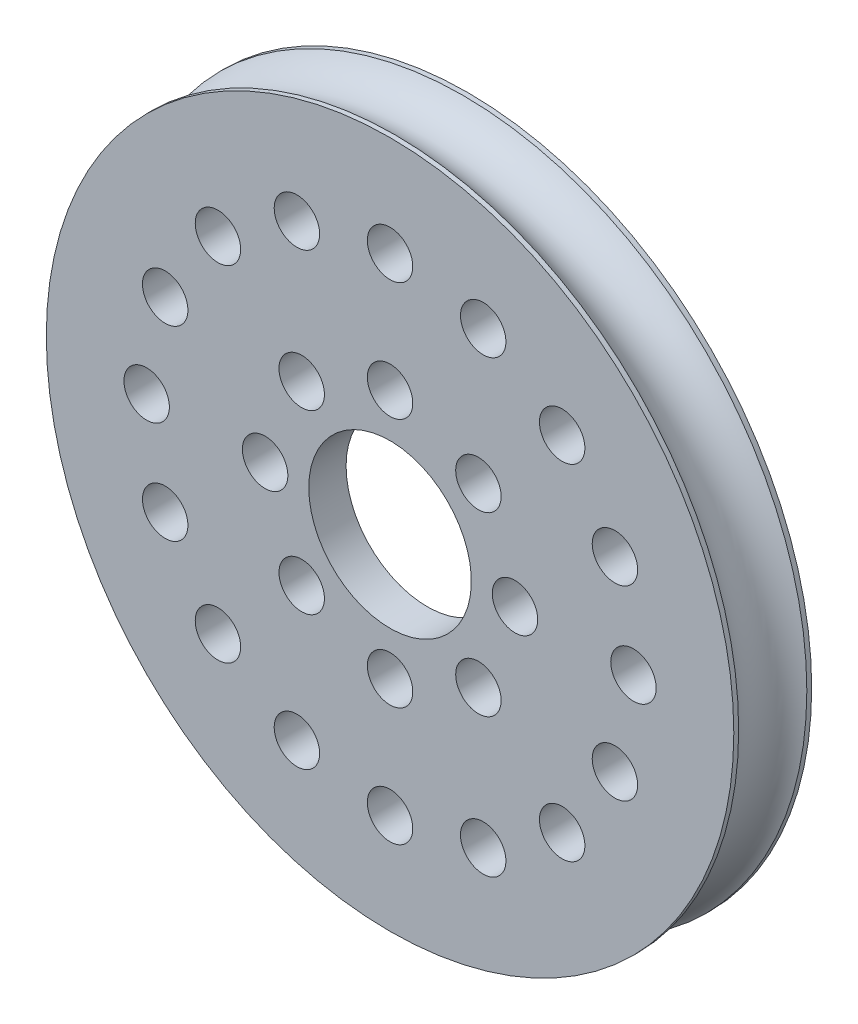
ISO-10303-21;
HEADER;
FILE_DESCRIPTION(('STEP AP214'),'2;1');
FILE_NAME('part.step','',(''),(''),'','','');
FILE_SCHEMA(('AUTOMOTIVE_DESIGN { 1 0 10303 214 1 1 1 1 }'));
ENDSEC;
DATA;
#1=APPLICATION_CONTEXT('core data for automotive mechanical design processes');
#2=APPLICATION_PROTOCOL_DEFINITION('international standard','automotive_design',2000,#1);
#3=PRODUCT_CONTEXT('',#1,'mechanical');
#4=PRODUCT('Part','Part','',(#3));
#5=PRODUCT_RELATED_PRODUCT_CATEGORY('part','',(#4));
#6=PRODUCT_DEFINITION_FORMATION('','',#4);
#7=PRODUCT_DEFINITION_CONTEXT('part definition',#1,'design');
#8=PRODUCT_DEFINITION('design','',#6,#7);
#9=PRODUCT_DEFINITION_SHAPE('','',#8);
#10=(LENGTH_UNIT() NAMED_UNIT(*) SI_UNIT(.MILLI.,.METRE.));
#11=(NAMED_UNIT(*) PLANE_ANGLE_UNIT() SI_UNIT($,.RADIAN.));
#12=(NAMED_UNIT(*) SI_UNIT($,.STERADIAN.) SOLID_ANGLE_UNIT());
#13=UNCERTAINTY_MEASURE_WITH_UNIT(LENGTH_MEASURE(1.E-05),#10,'distance_accuracy_value','');
#14=(GEOMETRIC_REPRESENTATION_CONTEXT(3) GLOBAL_UNCERTAINTY_ASSIGNED_CONTEXT((#13)) GLOBAL_UNIT_ASSIGNED_CONTEXT((#10,
#11,#12)) REPRESENTATION_CONTEXT('',''));
#15=CARTESIAN_POINT('',(0.,0.,0.));
#16=DIRECTION('',(0.,0.,1.));
#17=DIRECTION('',(1.,0.,0.));
#18=AXIS2_PLACEMENT_3D('',#15,#16,#17);
#19=CARTESIAN_POINT('',(0.,0.,-3.048));
#20=DIRECTION('',(0.,0.,1.));
#21=DIRECTION('',(1.,0.,0.));
#22=AXIS2_PLACEMENT_3D('',#19,#20,#21);
#23=PLANE('',#22);
#24=CARTESIAN_POINT('',(0.,0.,-3.048));
#25=DIRECTION('',(0.,0.,-1.));
#26=DIRECTION('',(-1.,0.,0.));
#27=AXIS2_PLACEMENT_3D('',#24,#25,#26);
#28=CIRCLE('',#27,26.90495);
#29=CARTESIAN_POINT('',(-26.90495,0.,-3.048));
#30=VERTEX_POINT('',#29);
#31=EDGE_CURVE('E18',#30,#30,#28,.F.);
#32=ORIENTED_EDGE('',*,*,#31,.F.);
#33=EDGE_LOOP('',(#32));
#34=FACE_BOUND('',#33,.T.);
#35=CARTESIAN_POINT('',(0.,0.,-3.048));
#36=DIRECTION('',(0.,0.,-1.));
#37=DIRECTION('',(-1.,0.,0.));
#38=AXIS2_PLACEMENT_3D('',#35,#36,#37);
#39=CIRCLE('',#38,23.114);
#40=CARTESIAN_POINT('',(-23.114,0.,-3.048));
#41=VERTEX_POINT('',#40);
#42=EDGE_CURVE('E182',#41,#41,#39,.F.);
#43=ORIENTED_EDGE('',*,*,#42,.T.);
#44=EDGE_LOOP('',(#43));
#45=FACE_BOUND('',#44,.T.);
#46=ADVANCED_FACE('F15',(#34,#45),#23,.F.);
#47=CARTESIAN_POINT('',(0.,0.,0.));
#48=DIRECTION('',(0.,0.,-1.));
#49=DIRECTION('',(-1.,0.,0.));
#50=AXIS2_PLACEMENT_3D('',#47,#48,#49);
#51=CYLINDRICAL_SURFACE('',#50,26.90495);
#52=ORIENTED_EDGE('',*,*,#31,.T.);
#53=EDGE_LOOP('',(#52));
#54=FACE_BOUND('',#53,.T.);
#55=CARTESIAN_POINT('',(0.,0.,-2.667));
#56=DIRECTION('',(0.,0.,-1.));
#57=DIRECTION('',(-1.,0.,0.));
#58=AXIS2_PLACEMENT_3D('',#55,#56,#57);
#59=CIRCLE('',#58,26.90495);
#60=CARTESIAN_POINT('',(-26.90495,0.,-2.667));
#61=VERTEX_POINT('',#60);
#62=EDGE_CURVE('E30',#61,#61,#59,.T.);
#63=ORIENTED_EDGE('',*,*,#62,.T.);
#64=EDGE_LOOP('',(#63));
#65=FACE_BOUND('',#64,.T.);
#66=ADVANCED_FACE('F190',(#54,#65),#51,.T.);
#67=CARTESIAN_POINT('',(0.,0.,0.127));
#68=DIRECTION('',(0.,0.,-1.));
#69=DIRECTION('',(-1.,0.,0.));
#70=AXIS2_PLACEMENT_3D('',#67,#68,#69);
#71=CYLINDRICAL_SURFACE('',#70,23.114);
#72=ORIENTED_EDGE('',*,*,#42,.F.);
#73=EDGE_LOOP('',(#72));
#74=FACE_BOUND('',#73,.T.);
#75=CARTESIAN_POINT('',(0.,0.,0.127));
#76=DIRECTION('',(0.,0.,-1.));
#77=DIRECTION('',(-1.,0.,0.));
#78=AXIS2_PLACEMENT_3D('',#75,#76,#77);
#79=CIRCLE('',#78,23.114);
#80=CARTESIAN_POINT('',(-23.114,0.,0.127));
#81=VERTEX_POINT('',#80);
#82=EDGE_CURVE('E180',#81,#81,#79,.T.);
#83=ORIENTED_EDGE('',*,*,#82,.F.);
#84=EDGE_LOOP('',(#83));
#85=FACE_BOUND('',#84,.T.);
#86=ADVANCED_FACE('F197',(#74,#85),#71,.F.);
#87=CARTESIAN_POINT('',(0.,0.,0.127));
#88=DIRECTION('',(0.,0.,-1.));
#89=DIRECTION('',(-1.,0.,0.));
#90=AXIS2_PLACEMENT_3D('',#87,#88,#89);
#91=PLANE('',#90);
#92=CARTESIAN_POINT('',(0.,0.,0.127));
#93=DIRECTION('',(0.,0.,-1.));
#94=DIRECTION('',(-1.,0.,0.));
#95=AXIS2_PLACEMENT_3D('',#92,#93,#94);
#96=CIRCLE('',#95,6.3627);
#97=CARTESIAN_POINT('',(-6.3627,0.,0.127));
#98=VERTEX_POINT('',#97);
#99=EDGE_CURVE('E105',#98,#98,#96,.F.);
#100=ORIENTED_EDGE('',*,*,#99,.T.);
#101=EDGE_LOOP('',(#100));
#102=FACE_BOUND('',#101,.T.);
#103=CARTESIAN_POINT('',(6.91479721322326,6.91479721322324,0.127));
#104=DIRECTION('',(0.,0.,-1.));
#105=DIRECTION('',(-1.,0.,0.));
#106=AXIS2_PLACEMENT_3D('',#103,#104,#105);
#107=CIRCLE('',#106,1.778);
#108=CARTESIAN_POINT('',(5.13679721322326,6.91479721322324,0.127));
#109=VERTEX_POINT('',#108);
#110=EDGE_CURVE('E111',#109,#109,#107,.F.);
#111=ORIENTED_EDGE('',*,*,#110,.T.);
#112=EDGE_LOOP('',(#111));
#113=FACE_BOUND('',#112,.T.);
#114=CARTESIAN_POINT('',(6.91479721322321,-6.91479721322328,0.127));
#115=DIRECTION('',(0.,0.,-1.));
#116=DIRECTION('',(-1.,0.,0.));
#117=AXIS2_PLACEMENT_3D('',#114,#115,#116);
#118=CIRCLE('',#117,1.778);
#119=CARTESIAN_POINT('',(5.13679721322321,-6.91479721322328,0.127));
#120=VERTEX_POINT('',#119);
#121=EDGE_CURVE('E117',#120,#120,#118,.F.);
#122=ORIENTED_EDGE('',*,*,#121,.T.);
#123=EDGE_LOOP('',(#122));
#124=FACE_BOUND('',#123,.T.);
#125=CARTESIAN_POINT('',(-6.91479721322331,-6.91479721322319,0.127));
#126=DIRECTION('',(0.,0.,-1.));
#127=DIRECTION('',(-1.,0.,0.));
#128=AXIS2_PLACEMENT_3D('',#125,#126,#127);
#129=CIRCLE('',#128,1.778);
#130=CARTESIAN_POINT('',(-8.69279721322331,-6.91479721322319,0.127));
#131=VERTEX_POINT('',#130);
#132=EDGE_CURVE('E123',#131,#131,#129,.F.);
#133=ORIENTED_EDGE('',*,*,#132,.T.);
#134=EDGE_LOOP('',(#133));
#135=FACE_BOUND('',#134,.T.);
#136=CARTESIAN_POINT('',(-6.91479721322316,6.91479721322333,0.127));
#137=DIRECTION('',(0.,0.,-1.));
#138=DIRECTION('',(-1.,0.,0.));
#139=AXIS2_PLACEMENT_3D('',#136,#137,#138);
#140=CIRCLE('',#139,1.778);
#141=CARTESIAN_POINT('',(-8.69279721322316,6.91479721322333,0.127));
#142=VERTEX_POINT('',#141);
#143=EDGE_CURVE('E129',#142,#142,#140,.F.);
#144=ORIENTED_EDGE('',*,*,#143,.T.);
#145=EDGE_LOOP('',(#144));
#146=FACE_BOUND('',#145,.T.);
#147=ORIENTED_EDGE('',*,*,#82,.T.);
#148=EDGE_LOOP('',(#147));
#149=FACE_BOUND('',#148,.T.);
#150=CARTESIAN_POINT('',(-9.779,1.02429588037641E-13,0.127));
#151=DIRECTION('',(0.,0.,-1.));
#152=DIRECTION('',(-1.,0.,0.));
#153=AXIS2_PLACEMENT_3D('',#150,#151,#152);
#154=CIRCLE('',#153,1.778);
#155=CARTESIAN_POINT('',(-11.557,1.02429588037641E-13,0.127));
#156=VERTEX_POINT('',#155);
#157=EDGE_CURVE('E126',#156,#156,#154,.F.);
#158=ORIENTED_EDGE('',*,*,#157,.T.);
#159=EDGE_LOOP('',(#158));
#160=FACE_BOUND('',#159,.T.);
#161=CARTESIAN_POINT('',(0.,-9.779,0.127));
#162=DIRECTION('',(0.,0.,-1.));
#163=DIRECTION('',(-1.,0.,0.));
#164=AXIS2_PLACEMENT_3D('',#161,#162,#163);
#165=CIRCLE('',#164,1.778);
#166=CARTESIAN_POINT('',(-1.778,-9.779,0.127));
#167=VERTEX_POINT('',#166);
#168=EDGE_CURVE('E120',#167,#167,#165,.F.);
#169=ORIENTED_EDGE('',*,*,#168,.T.);
#170=EDGE_LOOP('',(#169));
#171=FACE_BOUND('',#170,.T.);
#172=CARTESIAN_POINT('',(9.779,0.,0.127));
#173=DIRECTION('',(0.,0.,-1.));
#174=DIRECTION('',(-1.,0.,0.));
#175=AXIS2_PLACEMENT_3D('',#172,#173,#174);
#176=CIRCLE('',#175,1.778);
#177=CARTESIAN_POINT('',(8.001,0.,0.127));
#178=VERTEX_POINT('',#177);
#179=EDGE_CURVE('E114',#178,#178,#176,.F.);
#180=ORIENTED_EDGE('',*,*,#179,.T.);
#181=EDGE_LOOP('',(#180));
#182=FACE_BOUND('',#181,.T.);
#183=CARTESIAN_POINT('',(0.,9.779,0.127));
#184=DIRECTION('',(0.,0.,-1.));
#185=DIRECTION('',(-1.,0.,0.));
#186=AXIS2_PLACEMENT_3D('',#183,#184,#185);
#187=CIRCLE('',#186,1.778);
#188=CARTESIAN_POINT('',(-1.778,9.779,0.127));
#189=VERTEX_POINT('',#188);
#190=EDGE_CURVE('E108',#189,#189,#187,.F.);
#191=ORIENTED_EDGE('',*,*,#190,.T.);
#192=EDGE_LOOP('',(#191));
#193=FACE_BOUND('',#192,.T.);
#194=CARTESIAN_POINT('',(-19.05,0.,0.126999999999999));
#195=DIRECTION('',(0.,0.,-1.));
#196=DIRECTION('',(-1.,0.,0.));
#197=AXIS2_PLACEMENT_3D('',#194,#195,#196);
#198=CIRCLE('',#197,1.77799999999999);
#199=CARTESIAN_POINT('',(-20.828,0.,0.126999999999999));
#200=VERTEX_POINT('',#199);
#201=EDGE_CURVE('E132',#200,#200,#198,.F.);
#202=ORIENTED_EDGE('',*,*,#201,.T.);
#203=EDGE_LOOP('',(#202));
#204=FACE_BOUND('',#203,.T.);
#205=CARTESIAN_POINT('',(-17.59990509434,-7.29011938655498,0.126999999999999));
#206=DIRECTION('',(0.,0.,-1.));
#207=DIRECTION('',(-1.,0.,0.));
#208=AXIS2_PLACEMENT_3D('',#205,#206,#207);
#209=CIRCLE('',#208,1.77799999999999);
#210=CARTESIAN_POINT('',(-19.37790509434,-7.29011938655498,0.126999999999999));
#211=VERTEX_POINT('',#210);
#212=EDGE_CURVE('E135',#211,#211,#209,.F.);
#213=ORIENTED_EDGE('',*,*,#212,.T.);
#214=EDGE_LOOP('',(#213));
#215=FACE_BOUND('',#214,.T.);
#216=CARTESIAN_POINT('',(-13.4703841816037,-13.4703841816038,0.126999999999999));
#217=DIRECTION('',(0.,0.,-1.));
#218=DIRECTION('',(-1.,0.,0.));
#219=AXIS2_PLACEMENT_3D('',#216,#217,#218);
#220=CIRCLE('',#219,1.77799999999999);
#221=CARTESIAN_POINT('',(-15.2483841816037,-13.4703841816038,0.126999999999999));
#222=VERTEX_POINT('',#221);
#223=EDGE_CURVE('E138',#222,#222,#220,.F.);
#224=ORIENTED_EDGE('',*,*,#223,.T.);
#225=EDGE_LOOP('',(#224));
#226=FACE_BOUND('',#225,.T.);
#227=CARTESIAN_POINT('',(-7.29011938655491,-17.59990509434,0.126999999999999));
#228=DIRECTION('',(0.,0.,-1.));
#229=DIRECTION('',(-1.,0.,0.));
#230=AXIS2_PLACEMENT_3D('',#227,#228,#229);
#231=CIRCLE('',#230,1.77799999999999);
#232=CARTESIAN_POINT('',(-9.06811938655491,-17.59990509434,0.126999999999999));
#233=VERTEX_POINT('',#232);
#234=EDGE_CURVE('E141',#233,#233,#231,.F.);
#235=ORIENTED_EDGE('',*,*,#234,.T.);
#236=EDGE_LOOP('',(#235));
#237=FACE_BOUND('',#236,.T.);
#238=CARTESIAN_POINT('',(0.,-19.05,0.126999999999999));
#239=DIRECTION('',(0.,0.,-1.));
#240=DIRECTION('',(-1.,0.,0.));
#241=AXIS2_PLACEMENT_3D('',#238,#239,#240);
#242=CIRCLE('',#241,1.77799999999999);
#243=CARTESIAN_POINT('',(-1.77799999999993,-19.05,0.126999999999999));
#244=VERTEX_POINT('',#243);
#245=EDGE_CURVE('E144',#244,#244,#242,.F.);
#246=ORIENTED_EDGE('',*,*,#245,.T.);
#247=EDGE_LOOP('',(#246));
#248=FACE_BOUND('',#247,.T.);
#249=CARTESIAN_POINT('',(7.29011938655504,-17.59990509434,0.126999999999999));
#250=DIRECTION('',(0.,0.,-1.));
#251=DIRECTION('',(-1.,0.,0.));
#252=AXIS2_PLACEMENT_3D('',#249,#250,#251);
#253=CIRCLE('',#252,1.77799999999999);
#254=CARTESIAN_POINT('',(5.51211938655505,-17.59990509434,0.126999999999999));
#255=VERTEX_POINT('',#254);
#256=EDGE_CURVE('E147',#255,#255,#253,.F.);
#257=ORIENTED_EDGE('',*,*,#256,.T.);
#258=EDGE_LOOP('',(#257));
#259=FACE_BOUND('',#258,.T.);
#260=CARTESIAN_POINT('',(13.4703841816038,-13.4703841816037,0.126999999999999));
#261=DIRECTION('',(0.,0.,-1.));
#262=DIRECTION('',(-1.,0.,0.));
#263=AXIS2_PLACEMENT_3D('',#260,#261,#262);
#264=CIRCLE('',#263,1.77799999999999);
#265=CARTESIAN_POINT('',(11.6923841816038,-13.4703841816037,0.126999999999999));
#266=VERTEX_POINT('',#265);
#267=EDGE_CURVE('E150',#266,#266,#264,.F.);
#268=ORIENTED_EDGE('',*,*,#267,.T.);
#269=EDGE_LOOP('',(#268));
#270=FACE_BOUND('',#269,.T.);
#271=CARTESIAN_POINT('',(17.5999050943401,-7.29011938655485,0.126999999999999));
#272=DIRECTION('',(0.,0.,-1.));
#273=DIRECTION('',(-1.,0.,0.));
#274=AXIS2_PLACEMENT_3D('',#271,#272,#273);
#275=CIRCLE('',#274,1.77799999999999);
#276=CARTESIAN_POINT('',(15.8219050943401,-7.29011938655485,0.126999999999999));
#277=VERTEX_POINT('',#276);
#278=EDGE_CURVE('E153',#277,#277,#275,.F.);
#279=ORIENTED_EDGE('',*,*,#278,.T.);
#280=EDGE_LOOP('',(#279));
#281=FACE_BOUND('',#280,.T.);
#282=CARTESIAN_POINT('',(19.05,0.,0.126999999999999));
#283=DIRECTION('',(0.,0.,-1.));
#284=DIRECTION('',(-1.,0.,0.));
#285=AXIS2_PLACEMENT_3D('',#282,#283,#284);
#286=CIRCLE('',#285,1.77799999999999);
#287=CARTESIAN_POINT('',(17.272,0.,0.126999999999999));
#288=VERTEX_POINT('',#287);
#289=EDGE_CURVE('E156',#288,#288,#286,.F.);
#290=ORIENTED_EDGE('',*,*,#289,.T.);
#291=EDGE_LOOP('',(#290));
#292=FACE_BOUND('',#291,.T.);
#293=CARTESIAN_POINT('',(17.59990509434,7.2901193865551,0.126999999999999));
#294=DIRECTION('',(0.,0.,-1.));
#295=DIRECTION('',(-1.,0.,0.));
#296=AXIS2_PLACEMENT_3D('',#293,#294,#295);
#297=CIRCLE('',#296,1.77799999999999);
#298=CARTESIAN_POINT('',(15.82190509434,7.2901193865551,0.126999999999999));
#299=VERTEX_POINT('',#298);
#300=EDGE_CURVE('E159',#299,#299,#297,.F.);
#301=ORIENTED_EDGE('',*,*,#300,.T.);
#302=EDGE_LOOP('',(#301));
#303=FACE_BOUND('',#302,.T.);
#304=CARTESIAN_POINT('',(13.4703841816036,13.4703841816038,0.126999999999999));
#305=DIRECTION('',(0.,0.,-1.));
#306=DIRECTION('',(-1.,0.,0.));
#307=AXIS2_PLACEMENT_3D('',#304,#305,#306);
#308=CIRCLE('',#307,1.77799999999999);
#309=CARTESIAN_POINT('',(11.6923841816036,13.4703841816038,0.126999999999999));
#310=VERTEX_POINT('',#309);
#311=EDGE_CURVE('E162',#310,#310,#308,.F.);
#312=ORIENTED_EDGE('',*,*,#311,.T.);
#313=EDGE_LOOP('',(#312));
#314=FACE_BOUND('',#313,.T.);
#315=CARTESIAN_POINT('',(7.29011938655478,17.5999050943401,0.126999999999999));
#316=DIRECTION('',(0.,0.,-1.));
#317=DIRECTION('',(-1.,0.,0.));
#318=AXIS2_PLACEMENT_3D('',#315,#316,#317);
#319=CIRCLE('',#318,1.77799999999999);
#320=CARTESIAN_POINT('',(5.51211938655479,17.5999050943401,0.126999999999999));
#321=VERTEX_POINT('',#320);
#322=EDGE_CURVE('E165',#321,#321,#319,.F.);
#323=ORIENTED_EDGE('',*,*,#322,.T.);
#324=EDGE_LOOP('',(#323));
#325=FACE_BOUND('',#324,.T.);
#326=CARTESIAN_POINT('',(-1.99538158514885E-13,19.05,0.126999999999999));
#327=DIRECTION('',(0.,0.,-1.));
#328=DIRECTION('',(-1.,0.,0.));
#329=AXIS2_PLACEMENT_3D('',#326,#327,#328);
#330=CIRCLE('',#329,1.77799999999999);
#331=CARTESIAN_POINT('',(-1.77800000000019,19.05,0.126999999999999));
#332=VERTEX_POINT('',#331);
#333=EDGE_CURVE('E168',#332,#332,#330,.F.);
#334=ORIENTED_EDGE('',*,*,#333,.T.);
#335=EDGE_LOOP('',(#334));
#336=FACE_BOUND('',#335,.T.);
#337=CARTESIAN_POINT('',(-7.29011938655515,17.5999050943399,0.126999999999999));
#338=DIRECTION('',(0.,0.,-1.));
#339=DIRECTION('',(-1.,0.,0.));
#340=AXIS2_PLACEMENT_3D('',#337,#338,#339);
#341=CIRCLE('',#340,1.77799999999999);
#342=CARTESIAN_POINT('',(-9.06811938655514,17.5999050943399,0.126999999999999));
#343=VERTEX_POINT('',#342);
#344=EDGE_CURVE('E171',#343,#343,#341,.F.);
#345=ORIENTED_EDGE('',*,*,#344,.T.);
#346=EDGE_LOOP('',(#345));
#347=FACE_BOUND('',#346,.T.);
#348=CARTESIAN_POINT('',(-13.4703841816039,13.4703841816036,0.126999999999999));
#349=DIRECTION('',(0.,0.,-1.));
#350=DIRECTION('',(-1.,0.,0.));
#351=AXIS2_PLACEMENT_3D('',#348,#349,#350);
#352=CIRCLE('',#351,1.77799999999999);
#353=CARTESIAN_POINT('',(-15.2483841816039,13.4703841816036,0.126999999999999));
#354=VERTEX_POINT('',#353);
#355=EDGE_CURVE('E174',#354,#354,#352,.F.);
#356=ORIENTED_EDGE('',*,*,#355,.T.);
#357=EDGE_LOOP('',(#356));
#358=FACE_BOUND('',#357,.T.);
#359=CARTESIAN_POINT('',(-17.5999050943401,7.29011938655472,0.126999999999999));
#360=DIRECTION('',(0.,0.,-1.));
#361=DIRECTION('',(-1.,0.,0.));
#362=AXIS2_PLACEMENT_3D('',#359,#360,#361);
#363=CIRCLE('',#362,1.77799999999999);
#364=CARTESIAN_POINT('',(-19.3779050943401,7.29011938655472,0.126999999999999));
#365=VERTEX_POINT('',#364);
#366=EDGE_CURVE('E177',#365,#365,#363,.F.);
#367=ORIENTED_EDGE('',*,*,#366,.T.);
#368=EDGE_LOOP('',(#367));
#369=FACE_BOUND('',#368,.T.);
#370=ADVANCED_FACE('F313',(#102,#113,#124,#135,#146,#149,#160,#171,#182,#193,#204,#215,#226,
#237,#248,#259,#270,#281,#292,#303,#314,#325,#336,#347,#358,#369),#91,.T.);
#371=CARTESIAN_POINT('',(0.,0.,0.));
#372=DIRECTION('',(0.,0.,-1.));
#373=DIRECTION('',(-1.,0.,0.));
#374=AXIS2_PLACEMENT_3D('',#371,#372,#373);
#375=TOROIDAL_SURFACE('',#374,28.515639556962,3.11563955696202);
#376=ORIENTED_EDGE('',*,*,#62,.F.);
#377=EDGE_LOOP('',(#376));
#378=FACE_BOUND('',#377,.T.);
#379=CARTESIAN_POINT('',(0.,0.,2.667));
#380=DIRECTION('',(0.,0.,-1.));
#381=DIRECTION('',(-1.,0.,0.));
#382=AXIS2_PLACEMENT_3D('',#379,#380,#381);
#383=CIRCLE('',#382,26.90495);
#384=CARTESIAN_POINT('',(-26.90495,0.,2.667));
#385=VERTEX_POINT('',#384);
#386=EDGE_CURVE('E104',#385,#385,#383,.F.);
#387=ORIENTED_EDGE('',*,*,#386,.F.);
#388=EDGE_LOOP('',(#387));
#389=FACE_BOUND('',#388,.T.);
#390=ADVANCED_FACE('F309',(#378,#389),#375,.F.);
#391=CARTESIAN_POINT('',(-17.5999050943401,7.29011938655472,0.127));
#392=DIRECTION('',(0.,0.,-1.));
#393=DIRECTION('',(-1.,0.,0.));
#394=AXIS2_PLACEMENT_3D('',#391,#392,#393);
#395=CYLINDRICAL_SURFACE('',#394,1.77799999999999);
#396=CARTESIAN_POINT('',(-17.5999050943401,7.29011938655472,3.048));
#397=DIRECTION('',(0.,0.,-1.));
#398=DIRECTION('',(-1.,0.,0.));
#399=AXIS2_PLACEMENT_3D('',#396,#397,#398);
#400=CIRCLE('',#399,1.77799999999999);
#401=CARTESIAN_POINT('',(-19.3779050943401,7.29011938655472,3.048));
#402=VERTEX_POINT('',#401);
#403=EDGE_CURVE('E101',#402,#402,#400,.F.);
#404=ORIENTED_EDGE('',*,*,#403,.T.);
#405=EDGE_LOOP('',(#404));
#406=FACE_BOUND('',#405,.T.);
#407=ORIENTED_EDGE('',*,*,#366,.F.);
#408=EDGE_LOOP('',(#407));
#409=FACE_BOUND('',#408,.T.);
#410=ADVANCED_FACE('F305',(#406,#409),#395,.F.);
#411=CARTESIAN_POINT('',(-13.4703841816039,13.4703841816036,0.127));
#412=DIRECTION('',(0.,0.,-1.));
#413=DIRECTION('',(-1.,0.,0.));
#414=AXIS2_PLACEMENT_3D('',#411,#412,#413);
#415=CYLINDRICAL_SURFACE('',#414,1.77799999999999);
#416=CARTESIAN_POINT('',(-13.4703841816039,13.4703841816036,3.048));
#417=DIRECTION('',(0.,0.,-1.));
#418=DIRECTION('',(-1.,0.,0.));
#419=AXIS2_PLACEMENT_3D('',#416,#417,#418);
#420=CIRCLE('',#419,1.77799999999999);
#421=CARTESIAN_POINT('',(-15.2483841816039,13.4703841816036,3.048));
#422=VERTEX_POINT('',#421);
#423=EDGE_CURVE('E98',#422,#422,#420,.F.);
#424=ORIENTED_EDGE('',*,*,#423,.T.);
#425=EDGE_LOOP('',(#424));
#426=FACE_BOUND('',#425,.T.);
#427=ORIENTED_EDGE('',*,*,#355,.F.);
#428=EDGE_LOOP('',(#427));
#429=FACE_BOUND('',#428,.T.);
#430=ADVANCED_FACE('F301',(#426,#429),#415,.F.);
#431=CARTESIAN_POINT('',(-7.29011938655515,17.5999050943399,0.127));
#432=DIRECTION('',(0.,0.,-1.));
#433=DIRECTION('',(-1.,0.,0.));
#434=AXIS2_PLACEMENT_3D('',#431,#432,#433);
#435=CYLINDRICAL_SURFACE('',#434,1.77799999999999);
#436=CARTESIAN_POINT('',(-7.29011938655515,17.5999050943399,3.048));
#437=DIRECTION('',(0.,0.,-1.));
#438=DIRECTION('',(-1.,0.,0.));
#439=AXIS2_PLACEMENT_3D('',#436,#437,#438);
#440=CIRCLE('',#439,1.77799999999999);
#441=CARTESIAN_POINT('',(-9.06811938655514,17.5999050943399,3.048));
#442=VERTEX_POINT('',#441);
#443=EDGE_CURVE('E95',#442,#442,#440,.F.);
#444=ORIENTED_EDGE('',*,*,#443,.T.);
#445=EDGE_LOOP('',(#444));
#446=FACE_BOUND('',#445,.T.);
#447=ORIENTED_EDGE('',*,*,#344,.F.);
#448=EDGE_LOOP('',(#447));
#449=FACE_BOUND('',#448,.T.);
#450=ADVANCED_FACE('F297',(#446,#449),#435,.F.);
#451=CARTESIAN_POINT('',(-1.99538158514885E-13,19.05,0.127));
#452=DIRECTION('',(0.,0.,-1.));
#453=DIRECTION('',(-1.,0.,0.));
#454=AXIS2_PLACEMENT_3D('',#451,#452,#453);
#455=CYLINDRICAL_SURFACE('',#454,1.77799999999999);
#456=CARTESIAN_POINT('',(-1.99538158514885E-13,19.05,3.048));
#457=DIRECTION('',(0.,0.,-1.));
#458=DIRECTION('',(-1.,0.,0.));
#459=AXIS2_PLACEMENT_3D('',#456,#457,#458);
#460=CIRCLE('',#459,1.77799999999999);
#461=CARTESIAN_POINT('',(-1.77800000000019,19.05,3.048));
#462=VERTEX_POINT('',#461);
#463=EDGE_CURVE('E92',#462,#462,#460,.F.);
#464=ORIENTED_EDGE('',*,*,#463,.T.);
#465=EDGE_LOOP('',(#464));
#466=FACE_BOUND('',#465,.T.);
#467=ORIENTED_EDGE('',*,*,#333,.F.);
#468=EDGE_LOOP('',(#467));
#469=FACE_BOUND('',#468,.T.);
#470=ADVANCED_FACE('F293',(#466,#469),#455,.F.);
#471=CARTESIAN_POINT('',(7.29011938655478,17.5999050943401,0.127));
#472=DIRECTION('',(0.,0.,-1.));
#473=DIRECTION('',(-1.,0.,0.));
#474=AXIS2_PLACEMENT_3D('',#471,#472,#473);
#475=CYLINDRICAL_SURFACE('',#474,1.77799999999999);
#476=CARTESIAN_POINT('',(7.29011938655478,17.5999050943401,3.048));
#477=DIRECTION('',(0.,0.,-1.));
#478=DIRECTION('',(-1.,0.,0.));
#479=AXIS2_PLACEMENT_3D('',#476,#477,#478);
#480=CIRCLE('',#479,1.77799999999999);
#481=CARTESIAN_POINT('',(5.51211938655479,17.5999050943401,3.048));
#482=VERTEX_POINT('',#481);
#483=EDGE_CURVE('E89',#482,#482,#480,.F.);
#484=ORIENTED_EDGE('',*,*,#483,.T.);
#485=EDGE_LOOP('',(#484));
#486=FACE_BOUND('',#485,.T.);
#487=ORIENTED_EDGE('',*,*,#322,.F.);
#488=EDGE_LOOP('',(#487));
#489=FACE_BOUND('',#488,.T.);
#490=ADVANCED_FACE('F289',(#486,#489),#475,.F.);
#491=CARTESIAN_POINT('',(13.4703841816036,13.4703841816038,0.127));
#492=DIRECTION('',(0.,0.,-1.));
#493=DIRECTION('',(-1.,0.,0.));
#494=AXIS2_PLACEMENT_3D('',#491,#492,#493);
#495=CYLINDRICAL_SURFACE('',#494,1.77799999999999);
#496=CARTESIAN_POINT('',(13.4703841816036,13.4703841816038,3.048));
#497=DIRECTION('',(0.,0.,-1.));
#498=DIRECTION('',(-1.,0.,0.));
#499=AXIS2_PLACEMENT_3D('',#496,#497,#498);
#500=CIRCLE('',#499,1.77799999999999);
#501=CARTESIAN_POINT('',(11.6923841816036,13.4703841816038,3.048));
#502=VERTEX_POINT('',#501);
#503=EDGE_CURVE('E86',#502,#502,#500,.F.);
#504=ORIENTED_EDGE('',*,*,#503,.T.);
#505=EDGE_LOOP('',(#504));
#506=FACE_BOUND('',#505,.T.);
#507=ORIENTED_EDGE('',*,*,#311,.F.);
#508=EDGE_LOOP('',(#507));
#509=FACE_BOUND('',#508,.T.);
#510=ADVANCED_FACE('F285',(#506,#509),#495,.F.);
#511=CARTESIAN_POINT('',(17.59990509434,7.2901193865551,0.127));
#512=DIRECTION('',(0.,0.,-1.));
#513=DIRECTION('',(-1.,0.,0.));
#514=AXIS2_PLACEMENT_3D('',#511,#512,#513);
#515=CYLINDRICAL_SURFACE('',#514,1.77799999999999);
#516=CARTESIAN_POINT('',(17.59990509434,7.2901193865551,3.048));
#517=DIRECTION('',(0.,0.,-1.));
#518=DIRECTION('',(-1.,0.,0.));
#519=AXIS2_PLACEMENT_3D('',#516,#517,#518);
#520=CIRCLE('',#519,1.77799999999999);
#521=CARTESIAN_POINT('',(15.82190509434,7.2901193865551,3.048));
#522=VERTEX_POINT('',#521);
#523=EDGE_CURVE('E83',#522,#522,#520,.F.);
#524=ORIENTED_EDGE('',*,*,#523,.T.);
#525=EDGE_LOOP('',(#524));
#526=FACE_BOUND('',#525,.T.);
#527=ORIENTED_EDGE('',*,*,#300,.F.);
#528=EDGE_LOOP('',(#527));
#529=FACE_BOUND('',#528,.T.);
#530=ADVANCED_FACE('F281',(#526,#529),#515,.F.);
#531=CARTESIAN_POINT('',(19.05,0.,0.127));
#532=DIRECTION('',(0.,0.,-1.));
#533=DIRECTION('',(-1.,0.,0.));
#534=AXIS2_PLACEMENT_3D('',#531,#532,#533);
#535=CYLINDRICAL_SURFACE('',#534,1.77799999999999);
#536=CARTESIAN_POINT('',(19.05,0.,3.048));
#537=DIRECTION('',(0.,0.,-1.));
#538=DIRECTION('',(-1.,0.,0.));
#539=AXIS2_PLACEMENT_3D('',#536,#537,#538);
#540=CIRCLE('',#539,1.77799999999999);
#541=CARTESIAN_POINT('',(17.272,0.,3.048));
#542=VERTEX_POINT('',#541);
#543=EDGE_CURVE('E80',#542,#542,#540,.F.);
#544=ORIENTED_EDGE('',*,*,#543,.T.);
#545=EDGE_LOOP('',(#544));
#546=FACE_BOUND('',#545,.T.);
#547=ORIENTED_EDGE('',*,*,#289,.F.);
#548=EDGE_LOOP('',(#547));
#549=FACE_BOUND('',#548,.T.);
#550=ADVANCED_FACE('F277',(#546,#549),#535,.F.);
#551=CARTESIAN_POINT('',(17.5999050943401,-7.29011938655485,0.127));
#552=DIRECTION('',(0.,0.,-1.));
#553=DIRECTION('',(-1.,0.,0.));
#554=AXIS2_PLACEMENT_3D('',#551,#552,#553);
#555=CYLINDRICAL_SURFACE('',#554,1.77799999999999);
#556=CARTESIAN_POINT('',(17.5999050943401,-7.29011938655485,3.048));
#557=DIRECTION('',(0.,0.,-1.));
#558=DIRECTION('',(-1.,0.,0.));
#559=AXIS2_PLACEMENT_3D('',#556,#557,#558);
#560=CIRCLE('',#559,1.77799999999999);
#561=CARTESIAN_POINT('',(15.8219050943401,-7.29011938655485,3.048));
#562=VERTEX_POINT('',#561);
#563=EDGE_CURVE('E77',#562,#562,#560,.F.);
#564=ORIENTED_EDGE('',*,*,#563,.T.);
#565=EDGE_LOOP('',(#564));
#566=FACE_BOUND('',#565,.T.);
#567=ORIENTED_EDGE('',*,*,#278,.F.);
#568=EDGE_LOOP('',(#567));
#569=FACE_BOUND('',#568,.T.);
#570=ADVANCED_FACE('F273',(#566,#569),#555,.F.);
#571=CARTESIAN_POINT('',(13.4703841816038,-13.4703841816037,0.127));
#572=DIRECTION('',(0.,0.,-1.));
#573=DIRECTION('',(-1.,0.,0.));
#574=AXIS2_PLACEMENT_3D('',#571,#572,#573);
#575=CYLINDRICAL_SURFACE('',#574,1.77799999999999);
#576=CARTESIAN_POINT('',(13.4703841816038,-13.4703841816037,3.048));
#577=DIRECTION('',(0.,0.,-1.));
#578=DIRECTION('',(-1.,0.,0.));
#579=AXIS2_PLACEMENT_3D('',#576,#577,#578);
#580=CIRCLE('',#579,1.77799999999999);
#581=CARTESIAN_POINT('',(11.6923841816038,-13.4703841816037,3.048));
#582=VERTEX_POINT('',#581);
#583=EDGE_CURVE('E74',#582,#582,#580,.F.);
#584=ORIENTED_EDGE('',*,*,#583,.T.);
#585=EDGE_LOOP('',(#584));
#586=FACE_BOUND('',#585,.T.);
#587=ORIENTED_EDGE('',*,*,#267,.F.);
#588=EDGE_LOOP('',(#587));
#589=FACE_BOUND('',#588,.T.);
#590=ADVANCED_FACE('F269',(#586,#589),#575,.F.);
#591=CARTESIAN_POINT('',(7.29011938655504,-17.59990509434,0.127));
#592=DIRECTION('',(0.,0.,-1.));
#593=DIRECTION('',(-1.,0.,0.));
#594=AXIS2_PLACEMENT_3D('',#591,#592,#593);
#595=CYLINDRICAL_SURFACE('',#594,1.77799999999999);
#596=CARTESIAN_POINT('',(7.29011938655504,-17.59990509434,3.048));
#597=DIRECTION('',(0.,0.,-1.));
#598=DIRECTION('',(-1.,0.,0.));
#599=AXIS2_PLACEMENT_3D('',#596,#597,#598);
#600=CIRCLE('',#599,1.77799999999999);
#601=CARTESIAN_POINT('',(5.51211938655505,-17.59990509434,3.048));
#602=VERTEX_POINT('',#601);
#603=EDGE_CURVE('E71',#602,#602,#600,.F.);
#604=ORIENTED_EDGE('',*,*,#603,.T.);
#605=EDGE_LOOP('',(#604));
#606=FACE_BOUND('',#605,.T.);
#607=ORIENTED_EDGE('',*,*,#256,.F.);
#608=EDGE_LOOP('',(#607));
#609=FACE_BOUND('',#608,.T.);
#610=ADVANCED_FACE('F265',(#606,#609),#595,.F.);
#611=CARTESIAN_POINT('',(0.,-19.05,0.127));
#612=DIRECTION('',(0.,0.,-1.));
#613=DIRECTION('',(-1.,0.,0.));
#614=AXIS2_PLACEMENT_3D('',#611,#612,#613);
#615=CYLINDRICAL_SURFACE('',#614,1.77799999999999);
#616=CARTESIAN_POINT('',(0.,-19.05,3.048));
#617=DIRECTION('',(0.,0.,-1.));
#618=DIRECTION('',(-1.,0.,0.));
#619=AXIS2_PLACEMENT_3D('',#616,#617,#618);
#620=CIRCLE('',#619,1.77799999999999);
#621=CARTESIAN_POINT('',(-1.77799999999993,-19.05,3.048));
#622=VERTEX_POINT('',#621);
#623=EDGE_CURVE('E68',#622,#622,#620,.F.);
#624=ORIENTED_EDGE('',*,*,#623,.T.);
#625=EDGE_LOOP('',(#624));
#626=FACE_BOUND('',#625,.T.);
#627=ORIENTED_EDGE('',*,*,#245,.F.);
#628=EDGE_LOOP('',(#627));
#629=FACE_BOUND('',#628,.T.);
#630=ADVANCED_FACE('F261',(#626,#629),#615,.F.);
#631=CARTESIAN_POINT('',(-7.29011938655491,-17.59990509434,0.127));
#632=DIRECTION('',(0.,0.,-1.));
#633=DIRECTION('',(-1.,0.,0.));
#634=AXIS2_PLACEMENT_3D('',#631,#632,#633);
#635=CYLINDRICAL_SURFACE('',#634,1.77799999999999);
#636=CARTESIAN_POINT('',(-7.29011938655491,-17.59990509434,3.048));
#637=DIRECTION('',(0.,0.,-1.));
#638=DIRECTION('',(-1.,0.,0.));
#639=AXIS2_PLACEMENT_3D('',#636,#637,#638);
#640=CIRCLE('',#639,1.77799999999999);
#641=CARTESIAN_POINT('',(-9.06811938655491,-17.59990509434,3.048));
#642=VERTEX_POINT('',#641);
#643=EDGE_CURVE('E65',#642,#642,#640,.F.);
#644=ORIENTED_EDGE('',*,*,#643,.T.);
#645=EDGE_LOOP('',(#644));
#646=FACE_BOUND('',#645,.T.);
#647=ORIENTED_EDGE('',*,*,#234,.F.);
#648=EDGE_LOOP('',(#647));
#649=FACE_BOUND('',#648,.T.);
#650=ADVANCED_FACE('F257',(#646,#649),#635,.F.);
#651=CARTESIAN_POINT('',(-13.4703841816037,-13.4703841816038,0.127));
#652=DIRECTION('',(0.,0.,-1.));
#653=DIRECTION('',(-1.,0.,0.));
#654=AXIS2_PLACEMENT_3D('',#651,#652,#653);
#655=CYLINDRICAL_SURFACE('',#654,1.77799999999999);
#656=CARTESIAN_POINT('',(-13.4703841816037,-13.4703841816038,3.048));
#657=DIRECTION('',(0.,0.,-1.));
#658=DIRECTION('',(-1.,0.,0.));
#659=AXIS2_PLACEMENT_3D('',#656,#657,#658);
#660=CIRCLE('',#659,1.77799999999999);
#661=CARTESIAN_POINT('',(-15.2483841816037,-13.4703841816038,3.048));
#662=VERTEX_POINT('',#661);
#663=EDGE_CURVE('E62',#662,#662,#660,.F.);
#664=ORIENTED_EDGE('',*,*,#663,.T.);
#665=EDGE_LOOP('',(#664));
#666=FACE_BOUND('',#665,.T.);
#667=ORIENTED_EDGE('',*,*,#223,.F.);
#668=EDGE_LOOP('',(#667));
#669=FACE_BOUND('',#668,.T.);
#670=ADVANCED_FACE('F253',(#666,#669),#655,.F.);
#671=CARTESIAN_POINT('',(-17.59990509434,-7.29011938655498,0.127));
#672=DIRECTION('',(0.,0.,-1.));
#673=DIRECTION('',(-1.,0.,0.));
#674=AXIS2_PLACEMENT_3D('',#671,#672,#673);
#675=CYLINDRICAL_SURFACE('',#674,1.77799999999999);
#676=CARTESIAN_POINT('',(-17.59990509434,-7.29011938655498,3.048));
#677=DIRECTION('',(0.,0.,-1.));
#678=DIRECTION('',(-1.,0.,0.));
#679=AXIS2_PLACEMENT_3D('',#676,#677,#678);
#680=CIRCLE('',#679,1.77799999999999);
#681=CARTESIAN_POINT('',(-19.37790509434,-7.29011938655498,3.048));
#682=VERTEX_POINT('',#681);
#683=EDGE_CURVE('E59',#682,#682,#680,.F.);
#684=ORIENTED_EDGE('',*,*,#683,.T.);
#685=EDGE_LOOP('',(#684));
#686=FACE_BOUND('',#685,.T.);
#687=ORIENTED_EDGE('',*,*,#212,.F.);
#688=EDGE_LOOP('',(#687));
#689=FACE_BOUND('',#688,.T.);
#690=ADVANCED_FACE('F249',(#686,#689),#675,.F.);
#691=CARTESIAN_POINT('',(-19.05,0.,0.127));
#692=DIRECTION('',(0.,0.,-1.));
#693=DIRECTION('',(-1.,0.,0.));
#694=AXIS2_PLACEMENT_3D('',#691,#692,#693);
#695=CYLINDRICAL_SURFACE('',#694,1.77799999999999);
#696=CARTESIAN_POINT('',(-19.05,0.,3.048));
#697=DIRECTION('',(0.,0.,-1.));
#698=DIRECTION('',(-1.,0.,0.));
#699=AXIS2_PLACEMENT_3D('',#696,#697,#698);
#700=CIRCLE('',#699,1.77799999999999);
#701=CARTESIAN_POINT('',(-20.828,0.,3.048));
#702=VERTEX_POINT('',#701);
#703=EDGE_CURVE('E56',#702,#702,#700,.F.);
#704=ORIENTED_EDGE('',*,*,#703,.T.);
#705=EDGE_LOOP('',(#704));
#706=FACE_BOUND('',#705,.T.);
#707=ORIENTED_EDGE('',*,*,#201,.F.);
#708=EDGE_LOOP('',(#707));
#709=FACE_BOUND('',#708,.T.);
#710=ADVANCED_FACE('F245',(#706,#709),#695,.F.);
#711=CARTESIAN_POINT('',(-6.91479721322316,6.91479721322333,-3.048));
#712=DIRECTION('',(0.,0.,-1.));
#713=DIRECTION('',(-1.,0.,0.));
#714=AXIS2_PLACEMENT_3D('',#711,#712,#713);
#715=CYLINDRICAL_SURFACE('',#714,1.778);
#716=CARTESIAN_POINT('',(-6.91479721322316,6.91479721322333,3.048));
#717=DIRECTION('',(0.,0.,-1.));
#718=DIRECTION('',(-1.,0.,0.));
#719=AXIS2_PLACEMENT_3D('',#716,#717,#718);
#720=CIRCLE('',#719,1.778);
#721=CARTESIAN_POINT('',(-8.69279721322316,6.91479721322333,3.048));
#722=VERTEX_POINT('',#721);
#723=EDGE_CURVE('E53',#722,#722,#720,.F.);
#724=ORIENTED_EDGE('',*,*,#723,.T.);
#725=EDGE_LOOP('',(#724));
#726=FACE_BOUND('',#725,.T.);
#727=ORIENTED_EDGE('',*,*,#143,.F.);
#728=EDGE_LOOP('',(#727));
#729=FACE_BOUND('',#728,.T.);
#730=ADVANCED_FACE('F241',(#726,#729),#715,.F.);
#731=CARTESIAN_POINT('',(-9.779,1.02429588037641E-13,-3.048));
#732=DIRECTION('',(0.,0.,-1.));
#733=DIRECTION('',(-1.,0.,0.));
#734=AXIS2_PLACEMENT_3D('',#731,#732,#733);
#735=CYLINDRICAL_SURFACE('',#734,1.778);
#736=CARTESIAN_POINT('',(-9.779,1.02429588037641E-13,3.048));
#737=DIRECTION('',(0.,0.,-1.));
#738=DIRECTION('',(-1.,0.,0.));
#739=AXIS2_PLACEMENT_3D('',#736,#737,#738);
#740=CIRCLE('',#739,1.778);
#741=CARTESIAN_POINT('',(-11.557,1.02429588037641E-13,3.048));
#742=VERTEX_POINT('',#741);
#743=EDGE_CURVE('E50',#742,#742,#740,.F.);
#744=ORIENTED_EDGE('',*,*,#743,.T.);
#745=EDGE_LOOP('',(#744));
#746=FACE_BOUND('',#745,.T.);
#747=ORIENTED_EDGE('',*,*,#157,.F.);
#748=EDGE_LOOP('',(#747));
#749=FACE_BOUND('',#748,.T.);
#750=ADVANCED_FACE('F237',(#746,#749),#735,.F.);
#751=CARTESIAN_POINT('',(-6.91479721322331,-6.91479721322319,-3.048));
#752=DIRECTION('',(0.,0.,-1.));
#753=DIRECTION('',(-1.,0.,0.));
#754=AXIS2_PLACEMENT_3D('',#751,#752,#753);
#755=CYLINDRICAL_SURFACE('',#754,1.778);
#756=CARTESIAN_POINT('',(-6.91479721322331,-6.91479721322319,3.048));
#757=DIRECTION('',(0.,0.,-1.));
#758=DIRECTION('',(-1.,0.,0.));
#759=AXIS2_PLACEMENT_3D('',#756,#757,#758);
#760=CIRCLE('',#759,1.778);
#761=CARTESIAN_POINT('',(-8.69279721322331,-6.91479721322319,3.048));
#762=VERTEX_POINT('',#761);
#763=EDGE_CURVE('E47',#762,#762,#760,.F.);
#764=ORIENTED_EDGE('',*,*,#763,.T.);
#765=EDGE_LOOP('',(#764));
#766=FACE_BOUND('',#765,.T.);
#767=ORIENTED_EDGE('',*,*,#132,.F.);
#768=EDGE_LOOP('',(#767));
#769=FACE_BOUND('',#768,.T.);
#770=ADVANCED_FACE('F233',(#766,#769),#755,.F.);
#771=CARTESIAN_POINT('',(0.,-9.779,-3.048));
#772=DIRECTION('',(0.,0.,-1.));
#773=DIRECTION('',(-1.,0.,0.));
#774=AXIS2_PLACEMENT_3D('',#771,#772,#773);
#775=CYLINDRICAL_SURFACE('',#774,1.778);
#776=CARTESIAN_POINT('',(0.,-9.779,3.048));
#777=DIRECTION('',(0.,0.,-1.));
#778=DIRECTION('',(-1.,0.,0.));
#779=AXIS2_PLACEMENT_3D('',#776,#777,#778);
#780=CIRCLE('',#779,1.778);
#781=CARTESIAN_POINT('',(-1.778,-9.779,3.048));
#782=VERTEX_POINT('',#781);
#783=EDGE_CURVE('E44',#782,#782,#780,.F.);
#784=ORIENTED_EDGE('',*,*,#783,.T.);
#785=EDGE_LOOP('',(#784));
#786=FACE_BOUND('',#785,.T.);
#787=ORIENTED_EDGE('',*,*,#168,.F.);
#788=EDGE_LOOP('',(#787));
#789=FACE_BOUND('',#788,.T.);
#790=ADVANCED_FACE('F229',(#786,#789),#775,.F.);
#791=CARTESIAN_POINT('',(6.91479721322321,-6.91479721322328,-3.048));
#792=DIRECTION('',(0.,0.,-1.));
#793=DIRECTION('',(-1.,0.,0.));
#794=AXIS2_PLACEMENT_3D('',#791,#792,#793);
#795=CYLINDRICAL_SURFACE('',#794,1.778);
#796=CARTESIAN_POINT('',(6.91479721322321,-6.91479721322328,3.048));
#797=DIRECTION('',(0.,0.,-1.));
#798=DIRECTION('',(-1.,0.,0.));
#799=AXIS2_PLACEMENT_3D('',#796,#797,#798);
#800=CIRCLE('',#799,1.778);
#801=CARTESIAN_POINT('',(5.13679721322321,-6.91479721322328,3.048));
#802=VERTEX_POINT('',#801);
#803=EDGE_CURVE('E41',#802,#802,#800,.F.);
#804=ORIENTED_EDGE('',*,*,#803,.T.);
#805=EDGE_LOOP('',(#804));
#806=FACE_BOUND('',#805,.T.);
#807=ORIENTED_EDGE('',*,*,#121,.F.);
#808=EDGE_LOOP('',(#807));
#809=FACE_BOUND('',#808,.T.);
#810=ADVANCED_FACE('F225',(#806,#809),#795,.F.);
#811=CARTESIAN_POINT('',(9.779,0.,-3.048));
#812=DIRECTION('',(0.,0.,-1.));
#813=DIRECTION('',(-1.,0.,0.));
#814=AXIS2_PLACEMENT_3D('',#811,#812,#813);
#815=CYLINDRICAL_SURFACE('',#814,1.778);
#816=CARTESIAN_POINT('',(9.779,0.,3.048));
#817=DIRECTION('',(0.,0.,-1.));
#818=DIRECTION('',(-1.,0.,0.));
#819=AXIS2_PLACEMENT_3D('',#816,#817,#818);
#820=CIRCLE('',#819,1.778);
#821=CARTESIAN_POINT('',(8.001,0.,3.048));
#822=VERTEX_POINT('',#821);
#823=EDGE_CURVE('E38',#822,#822,#820,.F.);
#824=ORIENTED_EDGE('',*,*,#823,.T.);
#825=EDGE_LOOP('',(#824));
#826=FACE_BOUND('',#825,.T.);
#827=ORIENTED_EDGE('',*,*,#179,.F.);
#828=EDGE_LOOP('',(#827));
#829=FACE_BOUND('',#828,.T.);
#830=ADVANCED_FACE('F221',(#826,#829),#815,.F.);
#831=CARTESIAN_POINT('',(6.91479721322326,6.91479721322324,-3.048));
#832=DIRECTION('',(0.,0.,-1.));
#833=DIRECTION('',(-1.,0.,0.));
#834=AXIS2_PLACEMENT_3D('',#831,#832,#833);
#835=CYLINDRICAL_SURFACE('',#834,1.778);
#836=CARTESIAN_POINT('',(6.91479721322326,6.91479721322324,3.048));
#837=DIRECTION('',(0.,0.,-1.));
#838=DIRECTION('',(-1.,0.,0.));
#839=AXIS2_PLACEMENT_3D('',#836,#837,#838);
#840=CIRCLE('',#839,1.778);
#841=CARTESIAN_POINT('',(5.13679721322326,6.91479721322324,3.048));
#842=VERTEX_POINT('',#841);
#843=EDGE_CURVE('E35',#842,#842,#840,.F.);
#844=ORIENTED_EDGE('',*,*,#843,.T.);
#845=EDGE_LOOP('',(#844));
#846=FACE_BOUND('',#845,.T.);
#847=ORIENTED_EDGE('',*,*,#110,.F.);
#848=EDGE_LOOP('',(#847));
#849=FACE_BOUND('',#848,.T.);
#850=ADVANCED_FACE('F217',(#846,#849),#835,.F.);
#851=CARTESIAN_POINT('',(0.,9.779,-3.048));
#852=DIRECTION('',(0.,0.,-1.));
#853=DIRECTION('',(-1.,0.,0.));
#854=AXIS2_PLACEMENT_3D('',#851,#852,#853);
#855=CYLINDRICAL_SURFACE('',#854,1.778);
#856=CARTESIAN_POINT('',(0.,9.779,3.048));
#857=DIRECTION('',(0.,0.,-1.));
#858=DIRECTION('',(-1.,0.,0.));
#859=AXIS2_PLACEMENT_3D('',#856,#857,#858);
#860=CIRCLE('',#859,1.778);
#861=CARTESIAN_POINT('',(-1.778,9.779,3.048));
#862=VERTEX_POINT('',#861);
#863=EDGE_CURVE('E27',#862,#862,#860,.F.);
#864=ORIENTED_EDGE('',*,*,#863,.T.);
#865=EDGE_LOOP('',(#864));
#866=FACE_BOUND('',#865,.T.);
#867=ORIENTED_EDGE('',*,*,#190,.F.);
#868=EDGE_LOOP('',(#867));
#869=FACE_BOUND('',#868,.T.);
#870=ADVANCED_FACE('F213',(#866,#869),#855,.F.);
#871=CARTESIAN_POINT('',(0.,0.,-3.048));
#872=DIRECTION('',(0.,0.,-1.));
#873=DIRECTION('',(-1.,0.,0.));
#874=AXIS2_PLACEMENT_3D('',#871,#872,#873);
#875=CYLINDRICAL_SURFACE('',#874,6.3627);
#876=CARTESIAN_POINT('',(0.,0.,3.048));
#877=DIRECTION('',(0.,0.,-1.));
#878=DIRECTION('',(-1.,0.,0.));
#879=AXIS2_PLACEMENT_3D('',#876,#877,#878);
#880=CIRCLE('',#879,6.3627);
#881=CARTESIAN_POINT('',(-6.3627,0.,3.048));
#882=VERTEX_POINT('',#881);
#883=EDGE_CURVE('E22',#882,#882,#880,.F.);
#884=ORIENTED_EDGE('',*,*,#883,.T.);
#885=EDGE_LOOP('',(#884));
#886=FACE_BOUND('',#885,.T.);
#887=ORIENTED_EDGE('',*,*,#99,.F.);
#888=EDGE_LOOP('',(#887));
#889=FACE_BOUND('',#888,.T.);
#890=ADVANCED_FACE('F206',(#886,#889),#875,.F.);
#891=CARTESIAN_POINT('',(0.,0.,0.));
#892=DIRECTION('',(0.,0.,-1.));
#893=DIRECTION('',(-1.,0.,0.));
#894=AXIS2_PLACEMENT_3D('',#891,#892,#893);
#895=CYLINDRICAL_SURFACE('',#894,26.90495);
#896=ORIENTED_EDGE('',*,*,#386,.T.);
#897=EDGE_LOOP('',(#896));
#898=FACE_BOUND('',#897,.T.);
#899=CARTESIAN_POINT('',(0.,0.,3.048));
#900=DIRECTION('',(0.,0.,-1.));
#901=DIRECTION('',(-1.,0.,0.));
#902=AXIS2_PLACEMENT_3D('',#899,#900,#901);
#903=CIRCLE('',#902,26.90495);
#904=CARTESIAN_POINT('',(-26.90495,0.,3.048));
#905=VERTEX_POINT('',#904);
#906=EDGE_CURVE('E9',#905,#905,#903,.T.);
#907=ORIENTED_EDGE('',*,*,#906,.T.);
#908=EDGE_LOOP('',(#907));
#909=FACE_BOUND('',#908,.T.);
#910=ADVANCED_FACE('F200',(#898,#909),#895,.T.);
#911=CARTESIAN_POINT('',(26.90495,0.,3.048));
#912=DIRECTION('',(0.,0.,-1.));
#913=DIRECTION('',(-1.,0.,0.));
#914=AXIS2_PLACEMENT_3D('',#911,#912,#913);
#915=PLANE('',#914);
#916=ORIENTED_EDGE('',*,*,#906,.F.);
#917=EDGE_LOOP('',(#916));
#918=FACE_BOUND('',#917,.T.);
#919=ORIENTED_EDGE('',*,*,#883,.F.);
#920=EDGE_LOOP('',(#919));
#921=FACE_BOUND('',#920,.T.);
#922=ORIENTED_EDGE('',*,*,#863,.F.);
#923=EDGE_LOOP('',(#922));
#924=FACE_BOUND('',#923,.T.);
#925=ORIENTED_EDGE('',*,*,#843,.F.);
#926=EDGE_LOOP('',(#925));
#927=FACE_BOUND('',#926,.T.);
#928=ORIENTED_EDGE('',*,*,#823,.F.);
#929=EDGE_LOOP('',(#928));
#930=FACE_BOUND('',#929,.T.);
#931=ORIENTED_EDGE('',*,*,#803,.F.);
#932=EDGE_LOOP('',(#931));
#933=FACE_BOUND('',#932,.T.);
#934=ORIENTED_EDGE('',*,*,#783,.F.);
#935=EDGE_LOOP('',(#934));
#936=FACE_BOUND('',#935,.T.);
#937=ORIENTED_EDGE('',*,*,#763,.F.);
#938=EDGE_LOOP('',(#937));
#939=FACE_BOUND('',#938,.T.);
#940=ORIENTED_EDGE('',*,*,#743,.F.);
#941=EDGE_LOOP('',(#940));
#942=FACE_BOUND('',#941,.T.);
#943=ORIENTED_EDGE('',*,*,#723,.F.);
#944=EDGE_LOOP('',(#943));
#945=FACE_BOUND('',#944,.T.);
#946=ORIENTED_EDGE('',*,*,#703,.F.);
#947=EDGE_LOOP('',(#946));
#948=FACE_BOUND('',#947,.T.);
#949=ORIENTED_EDGE('',*,*,#683,.F.);
#950=EDGE_LOOP('',(#949));
#951=FACE_BOUND('',#950,.T.);
#952=ORIENTED_EDGE('',*,*,#663,.F.);
#953=EDGE_LOOP('',(#952));
#954=FACE_BOUND('',#953,.T.);
#955=ORIENTED_EDGE('',*,*,#643,.F.);
#956=EDGE_LOOP('',(#955));
#957=FACE_BOUND('',#956,.T.);
#958=ORIENTED_EDGE('',*,*,#623,.F.);
#959=EDGE_LOOP('',(#958));
#960=FACE_BOUND('',#959,.T.);
#961=ORIENTED_EDGE('',*,*,#603,.F.);
#962=EDGE_LOOP('',(#961));
#963=FACE_BOUND('',#962,.T.);
#964=ORIENTED_EDGE('',*,*,#583,.F.);
#965=EDGE_LOOP('',(#964));
#966=FACE_BOUND('',#965,.T.);
#967=ORIENTED_EDGE('',*,*,#563,.F.);
#968=EDGE_LOOP('',(#967));
#969=FACE_BOUND('',#968,.T.);
#970=ORIENTED_EDGE('',*,*,#543,.F.);
#971=EDGE_LOOP('',(#970));
#972=FACE_BOUND('',#971,.T.);
#973=ORIENTED_EDGE('',*,*,#523,.F.);
#974=EDGE_LOOP('',(#973));
#975=FACE_BOUND('',#974,.T.);
#976=ORIENTED_EDGE('',*,*,#503,.F.);
#977=EDGE_LOOP('',(#976));
#978=FACE_BOUND('',#977,.T.);
#979=ORIENTED_EDGE('',*,*,#483,.F.);
#980=EDGE_LOOP('',(#979));
#981=FACE_BOUND('',#980,.T.);
#982=ORIENTED_EDGE('',*,*,#463,.F.);
#983=EDGE_LOOP('',(#982));
#984=FACE_BOUND('',#983,.T.);
#985=ORIENTED_EDGE('',*,*,#443,.F.);
#986=EDGE_LOOP('',(#985));
#987=FACE_BOUND('',#986,.T.);
#988=ORIENTED_EDGE('',*,*,#423,.F.);
#989=EDGE_LOOP('',(#988));
#990=FACE_BOUND('',#989,.T.);
#991=ORIENTED_EDGE('',*,*,#403,.F.);
#992=EDGE_LOOP('',(#991));
#993=FACE_BOUND('',#992,.T.);
#994=ADVANCED_FACE('F198',(#918,#921,#924,#927,#930,#933,#936,#939,#942,#945,#948,#951,#954,
#957,#960,#963,#966,#969,#972,#975,#978,#981,#984,#987,#990,#993),#915,.F.);
#995=CLOSED_SHELL('',(#46,#66,#86,#370,#390,#410,#430,#450,#470,#490,#510,#530,#550,#570,#590,
#610,#630,#650,#670,#690,#710,#730,#750,#770,#790,#810,#830,#850,#870,#890,#910,#994));
#996=MANIFOLD_SOLID_BREP('B1',#995);
#997=ADVANCED_BREP_SHAPE_REPRESENTATION('',(#18,#996),#14);
#998=SHAPE_DEFINITION_REPRESENTATION(#9,#997);
ENDSEC;
END-ISO-10303-21;
